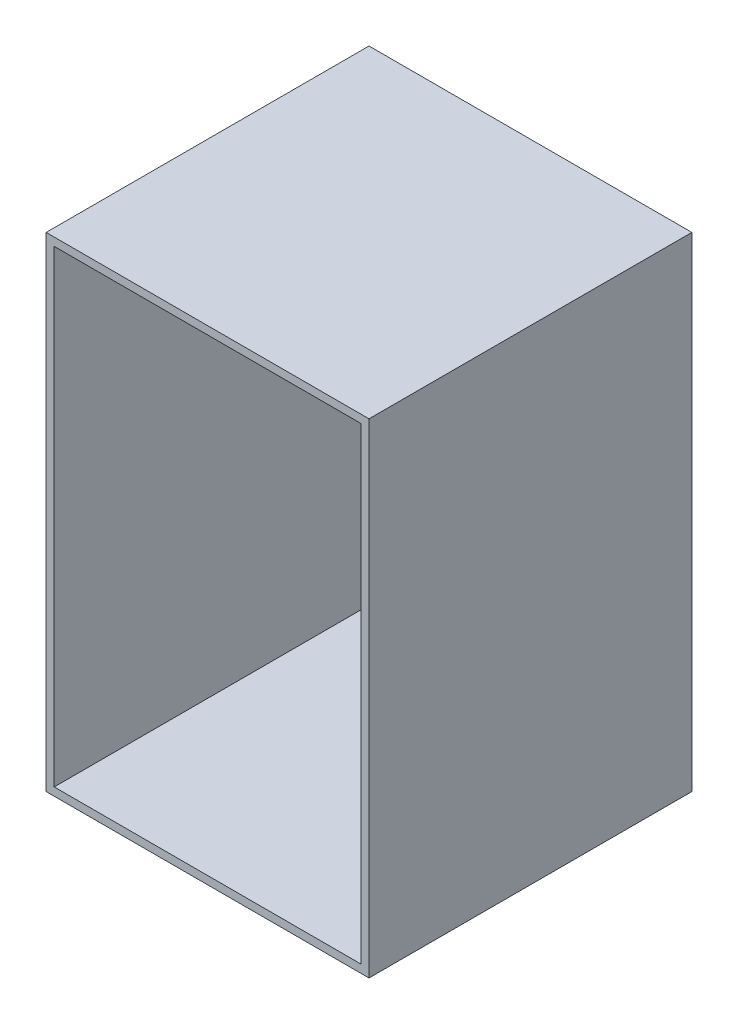
ISO-10303-21;
HEADER;
FILE_DESCRIPTION(('STEP AP214'),'2;1');
FILE_NAME('part.step','',(''),(''),'','','');
FILE_SCHEMA(('AUTOMOTIVE_DESIGN { 1 0 10303 214 1 1 1 1 }'));
ENDSEC;
DATA;
#1=APPLICATION_CONTEXT('core data for automotive mechanical design processes');
#2=APPLICATION_PROTOCOL_DEFINITION('international standard','automotive_design',2000,#1);
#3=PRODUCT_CONTEXT('',#1,'mechanical');
#4=PRODUCT('Part','Part','',(#3));
#5=PRODUCT_RELATED_PRODUCT_CATEGORY('part','',(#4));
#6=PRODUCT_DEFINITION_FORMATION('','',#4);
#7=PRODUCT_DEFINITION_CONTEXT('part definition',#1,'design');
#8=PRODUCT_DEFINITION('design','',#6,#7);
#9=PRODUCT_DEFINITION_SHAPE('','',#8);
#10=(LENGTH_UNIT() NAMED_UNIT(*) SI_UNIT(.MILLI.,.METRE.));
#11=(NAMED_UNIT(*) PLANE_ANGLE_UNIT() SI_UNIT($,.RADIAN.));
#12=(NAMED_UNIT(*) SI_UNIT($,.STERADIAN.) SOLID_ANGLE_UNIT());
#13=UNCERTAINTY_MEASURE_WITH_UNIT(LENGTH_MEASURE(1.E-05),#10,'distance_accuracy_value','');
#14=(GEOMETRIC_REPRESENTATION_CONTEXT(3) GLOBAL_UNCERTAINTY_ASSIGNED_CONTEXT((#13)) GLOBAL_UNIT_ASSIGNED_CONTEXT((#10,
#11,#12)) REPRESENTATION_CONTEXT('',''));
#15=CARTESIAN_POINT('',(0.,0.,0.));
#16=DIRECTION('',(0.,0.,1.));
#17=DIRECTION('',(1.,0.,0.));
#18=AXIS2_PLACEMENT_3D('',#15,#16,#17);
#19=CARTESIAN_POINT('',(-60.,180.,60.));
#20=DIRECTION('',(0.,0.,-1.));
#21=DIRECTION('',(-1.,0.,0.));
#22=AXIS2_PLACEMENT_3D('',#19,#20,#21);
#23=PLANE('',#22);
#24=DIRECTION('',(1.,0.,0.));
#25=VECTOR('',#24,1.);
#26=CARTESIAN_POINT('',(-60.,0.,60.));
#27=LINE('',#26,#25);
#28=CARTESIAN_POINT('',(-60.,0.,60.));
#29=VERTEX_POINT('',#28);
#30=CARTESIAN_POINT('',(60.,0.,60.));
#31=VERTEX_POINT('',#30);
#32=EDGE_CURVE('E83',#29,#31,#27,.T.);
#33=ORIENTED_EDGE('',*,*,#32,.T.);
#34=DIRECTION('',(0.,-1.,0.));
#35=VECTOR('',#34,1.);
#36=CARTESIAN_POINT('',(60.,180.,60.));
#37=LINE('',#36,#35);
#38=CARTESIAN_POINT('',(60.,180.,60.));
#39=VERTEX_POINT('',#38);
#40=EDGE_CURVE('E155',#39,#31,#37,.T.);
#41=ORIENTED_EDGE('',*,*,#40,.F.);
#42=DIRECTION('',(1.,0.,0.));
#43=VECTOR('',#42,1.);
#44=CARTESIAN_POINT('',(-60.,180.,60.));
#45=LINE('',#44,#43);
#46=CARTESIAN_POINT('',(-60.,180.,60.));
#47=VERTEX_POINT('',#46);
#48=EDGE_CURVE('E62',#47,#39,#45,.T.);
#49=ORIENTED_EDGE('',*,*,#48,.F.);
#50=DIRECTION('',(0.,-1.,0.));
#51=VECTOR('',#50,1.);
#52=CARTESIAN_POINT('',(-60.,180.,60.));
#53=LINE('',#52,#51);
#54=EDGE_CURVE('E165',#47,#29,#53,.T.);
#55=ORIENTED_EDGE('',*,*,#54,.T.);
#56=EDGE_LOOP('',(#33,#41,#49,#55));
#57=FACE_BOUND('',#56,.T.);
#58=DIRECTION('',(1.,0.,0.));
#59=VECTOR('',#58,1.);
#60=CARTESIAN_POINT('',(0.,3.,60.));
#61=LINE('',#60,#59);
#62=CARTESIAN_POINT('',(-57.,3.,60.));
#63=VERTEX_POINT('',#62);
#64=CARTESIAN_POINT('',(57.,3.,60.));
#65=VERTEX_POINT('',#64);
#66=EDGE_CURVE('E136',#63,#65,#61,.T.);
#67=ORIENTED_EDGE('',*,*,#66,.F.);
#68=DIRECTION('',(0.,-1.,0.));
#69=VECTOR('',#68,1.);
#70=CARTESIAN_POINT('',(-57.,180.,60.));
#71=LINE('',#70,#69);
#72=CARTESIAN_POINT('',(-57.,177.,60.));
#73=VERTEX_POINT('',#72);
#74=EDGE_CURVE('E131',#73,#63,#71,.T.);
#75=ORIENTED_EDGE('',*,*,#74,.F.);
#76=DIRECTION('',(1.,0.,0.));
#77=VECTOR('',#76,1.);
#78=CARTESIAN_POINT('',(0.,177.,60.));
#79=LINE('',#78,#77);
#80=CARTESIAN_POINT('',(57.,177.,60.));
#81=VERTEX_POINT('',#80);
#82=EDGE_CURVE('E53',#73,#81,#79,.T.);
#83=ORIENTED_EDGE('',*,*,#82,.T.);
#84=DIRECTION('',(0.,-1.,0.));
#85=VECTOR('',#84,1.);
#86=CARTESIAN_POINT('',(57.,180.,60.));
#87=LINE('',#86,#85);
#88=EDGE_CURVE('E144',#81,#65,#87,.T.);
#89=ORIENTED_EDGE('',*,*,#88,.T.);
#90=EDGE_LOOP('',(#67,#75,#83,#89));
#91=FACE_BOUND('',#90,.T.);
#92=ADVANCED_FACE('F38',(#57,#91),#23,.F.);
#93=CARTESIAN_POINT('',(60.,180.,60.));
#94=DIRECTION('',(-1.,0.,0.));
#95=DIRECTION('',(0.,0.,1.));
#96=AXIS2_PLACEMENT_3D('',#93,#94,#95);
#97=PLANE('',#96);
#98=DIRECTION('',(0.,0.,-1.));
#99=VECTOR('',#98,1.);
#100=CARTESIAN_POINT('',(60.,0.,60.));
#101=LINE('',#100,#99);
#102=CARTESIAN_POINT('',(60.,0.,-60.));
#103=VERTEX_POINT('',#102);
#104=EDGE_CURVE('E156',#31,#103,#101,.T.);
#105=ORIENTED_EDGE('',*,*,#104,.T.);
#106=DIRECTION('',(0.,-1.,0.));
#107=VECTOR('',#106,1.);
#108=CARTESIAN_POINT('',(60.,180.,-60.));
#109=LINE('',#108,#107);
#110=CARTESIAN_POINT('',(60.,180.,-60.));
#111=VERTEX_POINT('',#110);
#112=EDGE_CURVE('E11',#111,#103,#109,.T.);
#113=ORIENTED_EDGE('',*,*,#112,.F.);
#114=DIRECTION('',(0.,0.,-1.));
#115=VECTOR('',#114,1.);
#116=CARTESIAN_POINT('',(60.,180.,60.));
#117=LINE('',#116,#115);
#118=EDGE_CURVE('E149',#39,#111,#117,.T.);
#119=ORIENTED_EDGE('',*,*,#118,.F.);
#120=ORIENTED_EDGE('',*,*,#40,.T.);
#121=EDGE_LOOP('',(#105,#113,#119,#120));
#122=FACE_BOUND('',#121,.T.);
#123=ADVANCED_FACE('F40',(#122),#97,.F.);
#124=CARTESIAN_POINT('',(-60.,180.,-60.));
#125=DIRECTION('',(0.,0.,1.));
#126=DIRECTION('',(1.,0.,0.));
#127=AXIS2_PLACEMENT_3D('',#124,#125,#126);
#128=PLANE('',#127);
#129=DIRECTION('',(-1.,0.,0.));
#130=VECTOR('',#129,1.);
#131=CARTESIAN_POINT('',(-60.,0.,-60.));
#132=LINE('',#131,#130);
#133=CARTESIAN_POINT('',(-60.,0.,-60.));
#134=VERTEX_POINT('',#133);
#135=EDGE_CURVE('E159',#103,#134,#132,.T.);
#136=ORIENTED_EDGE('',*,*,#135,.T.);
#137=DIRECTION('',(0.,-1.,0.));
#138=VECTOR('',#137,1.);
#139=CARTESIAN_POINT('',(-60.,180.,-60.));
#140=LINE('',#139,#138);
#141=CARTESIAN_POINT('',(-60.,180.,-60.));
#142=VERTEX_POINT('',#141);
#143=EDGE_CURVE('E46',#142,#134,#140,.T.);
#144=ORIENTED_EDGE('',*,*,#143,.F.);
#145=DIRECTION('',(-1.,0.,0.));
#146=VECTOR('',#145,1.);
#147=CARTESIAN_POINT('',(-60.,180.,-60.));
#148=LINE('',#147,#146);
#149=EDGE_CURVE('E90',#111,#142,#148,.T.);
#150=ORIENTED_EDGE('',*,*,#149,.F.);
#151=ORIENTED_EDGE('',*,*,#112,.T.);
#152=EDGE_LOOP('',(#136,#144,#150,#151));
#153=FACE_BOUND('',#152,.T.);
#154=ADVANCED_FACE('F204',(#153),#128,.F.);
#155=CARTESIAN_POINT('',(-60.,180.,60.));
#156=DIRECTION('',(1.,0.,0.));
#157=DIRECTION('',(0.,0.,-1.));
#158=AXIS2_PLACEMENT_3D('',#155,#156,#157);
#159=PLANE('',#158);
#160=DIRECTION('',(0.,0.,1.));
#161=VECTOR('',#160,1.);
#162=CARTESIAN_POINT('',(-60.,0.,60.));
#163=LINE('',#162,#161);
#164=EDGE_CURVE('E161',#134,#29,#163,.T.);
#165=ORIENTED_EDGE('',*,*,#164,.T.);
#166=ORIENTED_EDGE('',*,*,#54,.F.);
#167=DIRECTION('',(0.,0.,1.));
#168=VECTOR('',#167,1.);
#169=CARTESIAN_POINT('',(-60.,180.,60.));
#170=LINE('',#169,#168);
#171=EDGE_CURVE('E152',#142,#47,#170,.T.);
#172=ORIENTED_EDGE('',*,*,#171,.F.);
#173=ORIENTED_EDGE('',*,*,#143,.T.);
#174=EDGE_LOOP('',(#165,#166,#172,#173));
#175=FACE_BOUND('',#174,.T.);
#176=ADVANCED_FACE('F170',(#175),#159,.F.);
#177=CARTESIAN_POINT('',(0.,180.,0.));
#178=DIRECTION('',(0.,-1.,0.));
#179=DIRECTION('',(0.,0.,-1.));
#180=AXIS2_PLACEMENT_3D('',#177,#178,#179);
#181=PLANE('',#180);
#182=ORIENTED_EDGE('',*,*,#118,.T.);
#183=ORIENTED_EDGE('',*,*,#149,.T.);
#184=ORIENTED_EDGE('',*,*,#171,.T.);
#185=ORIENTED_EDGE('',*,*,#48,.T.);
#186=EDGE_LOOP('',(#182,#183,#184,#185));
#187=FACE_BOUND('',#186,.T.);
#188=ADVANCED_FACE('F198',(#187),#181,.F.);
#189=CARTESIAN_POINT('',(0.,0.,0.));
#190=DIRECTION('',(0.,-1.,0.));
#191=DIRECTION('',(0.,0.,-1.));
#192=AXIS2_PLACEMENT_3D('',#189,#190,#191);
#193=PLANE('',#192);
#194=ORIENTED_EDGE('',*,*,#104,.F.);
#195=ORIENTED_EDGE('',*,*,#32,.F.);
#196=ORIENTED_EDGE('',*,*,#164,.F.);
#197=ORIENTED_EDGE('',*,*,#135,.F.);
#198=EDGE_LOOP('',(#194,#195,#196,#197));
#199=FACE_BOUND('',#198,.T.);
#200=ADVANCED_FACE('F174',(#199),#193,.T.);
#201=CARTESIAN_POINT('',(57.,180.,60.));
#202=DIRECTION('',(-1.,0.,0.));
#203=DIRECTION('',(0.,0.,1.));
#204=AXIS2_PLACEMENT_3D('',#201,#202,#203);
#205=PLANE('',#204);
#206=DIRECTION('',(0.,0.,-1.));
#207=VECTOR('',#206,1.);
#208=CARTESIAN_POINT('',(57.,3.,0.));
#209=LINE('',#208,#207);
#210=CARTESIAN_POINT('',(57.,3.,-57.));
#211=VERTEX_POINT('',#210);
#212=EDGE_CURVE('E120',#65,#211,#209,.T.);
#213=ORIENTED_EDGE('',*,*,#212,.F.);
#214=ORIENTED_EDGE('',*,*,#88,.F.);
#215=DIRECTION('',(0.,0.,-1.));
#216=VECTOR('',#215,1.);
#217=CARTESIAN_POINT('',(57.,177.,0.));
#218=LINE('',#217,#216);
#219=CARTESIAN_POINT('',(57.,177.,-57.));
#220=VERTEX_POINT('',#219);
#221=EDGE_CURVE('E138',#81,#220,#218,.T.);
#222=ORIENTED_EDGE('',*,*,#221,.T.);
#223=DIRECTION('',(0.,-1.,0.));
#224=VECTOR('',#223,1.);
#225=CARTESIAN_POINT('',(57.,180.,-57.));
#226=LINE('',#225,#224);
#227=EDGE_CURVE('E130',#220,#211,#226,.T.);
#228=ORIENTED_EDGE('',*,*,#227,.T.);
#229=EDGE_LOOP('',(#213,#214,#222,#228));
#230=FACE_BOUND('',#229,.T.);
#231=ADVANCED_FACE('F182',(#230),#205,.T.);
#232=CARTESIAN_POINT('',(-60.,180.,-57.));
#233=DIRECTION('',(0.,0.,1.));
#234=DIRECTION('',(1.,0.,0.));
#235=AXIS2_PLACEMENT_3D('',#232,#233,#234);
#236=PLANE('',#235);
#237=DIRECTION('',(-1.,0.,0.));
#238=VECTOR('',#237,1.);
#239=CARTESIAN_POINT('',(0.,3.,-57.));
#240=LINE('',#239,#238);
#241=CARTESIAN_POINT('',(-57.,3.,-57.));
#242=VERTEX_POINT('',#241);
#243=EDGE_CURVE('E113',#211,#242,#240,.T.);
#244=ORIENTED_EDGE('',*,*,#243,.F.);
#245=ORIENTED_EDGE('',*,*,#227,.F.);
#246=DIRECTION('',(-1.,0.,0.));
#247=VECTOR('',#246,1.);
#248=CARTESIAN_POINT('',(0.,177.,-57.));
#249=LINE('',#248,#247);
#250=CARTESIAN_POINT('',(-57.,177.,-57.));
#251=VERTEX_POINT('',#250);
#252=EDGE_CURVE('E128',#220,#251,#249,.T.);
#253=ORIENTED_EDGE('',*,*,#252,.T.);
#254=DIRECTION('',(0.,-1.,0.));
#255=VECTOR('',#254,1.);
#256=CARTESIAN_POINT('',(-57.,180.,-57.));
#257=LINE('',#256,#255);
#258=EDGE_CURVE('E126',#251,#242,#257,.T.);
#259=ORIENTED_EDGE('',*,*,#258,.T.);
#260=EDGE_LOOP('',(#244,#245,#253,#259));
#261=FACE_BOUND('',#260,.T.);
#262=ADVANCED_FACE('F127',(#261),#236,.T.);
#263=CARTESIAN_POINT('',(-57.,180.,60.));
#264=DIRECTION('',(1.,0.,0.));
#265=DIRECTION('',(0.,0.,-1.));
#266=AXIS2_PLACEMENT_3D('',#263,#264,#265);
#267=PLANE('',#266);
#268=DIRECTION('',(0.,0.,1.));
#269=VECTOR('',#268,1.);
#270=CARTESIAN_POINT('',(-57.,3.,0.));
#271=LINE('',#270,#269);
#272=EDGE_CURVE('E117',#242,#63,#271,.T.);
#273=ORIENTED_EDGE('',*,*,#272,.F.);
#274=ORIENTED_EDGE('',*,*,#258,.F.);
#275=DIRECTION('',(0.,0.,1.));
#276=VECTOR('',#275,1.);
#277=CARTESIAN_POINT('',(-57.,177.,0.));
#278=LINE('',#277,#276);
#279=EDGE_CURVE('E142',#251,#73,#278,.T.);
#280=ORIENTED_EDGE('',*,*,#279,.T.);
#281=ORIENTED_EDGE('',*,*,#74,.T.);
#282=EDGE_LOOP('',(#273,#274,#280,#281));
#283=FACE_BOUND('',#282,.T.);
#284=ADVANCED_FACE('F133',(#283),#267,.T.);
#285=CARTESIAN_POINT('',(0.,177.,0.));
#286=DIRECTION('',(0.,-1.,0.));
#287=DIRECTION('',(0.,0.,-1.));
#288=AXIS2_PLACEMENT_3D('',#285,#286,#287);
#289=PLANE('',#288);
#290=ORIENTED_EDGE('',*,*,#221,.F.);
#291=ORIENTED_EDGE('',*,*,#82,.F.);
#292=ORIENTED_EDGE('',*,*,#279,.F.);
#293=ORIENTED_EDGE('',*,*,#252,.F.);
#294=EDGE_LOOP('',(#290,#291,#292,#293));
#295=FACE_BOUND('',#294,.T.);
#296=ADVANCED_FACE('F187',(#295),#289,.T.);
#297=CARTESIAN_POINT('',(0.,3.,0.));
#298=DIRECTION('',(0.,-1.,0.));
#299=DIRECTION('',(0.,0.,-1.));
#300=AXIS2_PLACEMENT_3D('',#297,#298,#299);
#301=PLANE('',#300);
#302=ORIENTED_EDGE('',*,*,#212,.T.);
#303=ORIENTED_EDGE('',*,*,#243,.T.);
#304=ORIENTED_EDGE('',*,*,#272,.T.);
#305=ORIENTED_EDGE('',*,*,#66,.T.);
#306=EDGE_LOOP('',(#302,#303,#304,#305));
#307=FACE_BOUND('',#306,.T.);
#308=ADVANCED_FACE('F115',(#307),#301,.F.);
#309=CLOSED_SHELL('',(#92,#123,#154,#176,#188,#200,#231,#262,#284,#296,#308));
#310=MANIFOLD_SOLID_BREP('B2',#309);
#311=ADVANCED_BREP_SHAPE_REPRESENTATION('',(#18,#310),#14);
#312=SHAPE_DEFINITION_REPRESENTATION(#9,#311);
ENDSEC;
END-ISO-10303-21;
